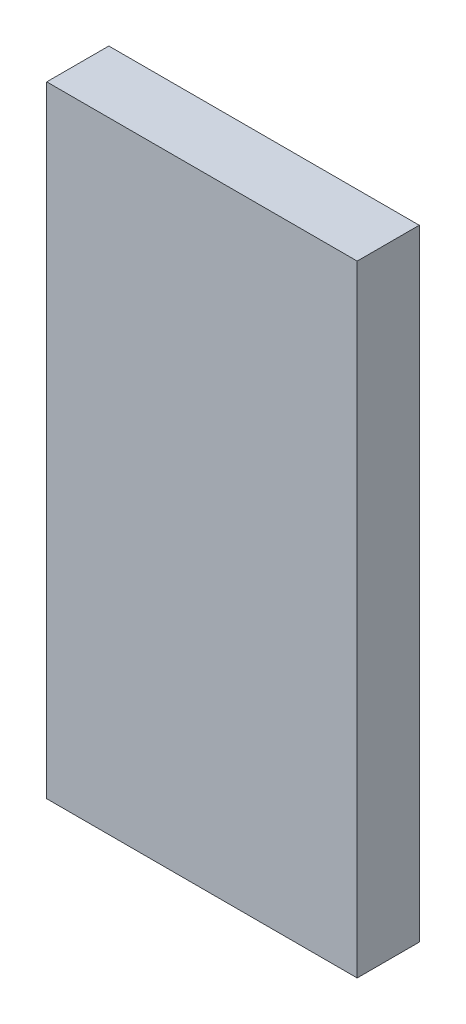
ISO-10303-21;
HEADER;
FILE_DESCRIPTION(('STEP AP214'),'2;1');
FILE_NAME('part.step','',(''),(''),'','','');
FILE_SCHEMA(('AUTOMOTIVE_DESIGN { 1 0 10303 214 1 1 1 1 }'));
ENDSEC;
DATA;
#1=APPLICATION_CONTEXT('core data for automotive mechanical design processes');
#2=APPLICATION_PROTOCOL_DEFINITION('international standard','automotive_design',2000,#1);
#3=PRODUCT_CONTEXT('',#1,'mechanical');
#4=PRODUCT('Part','Part','',(#3));
#5=PRODUCT_RELATED_PRODUCT_CATEGORY('part','',(#4));
#6=PRODUCT_DEFINITION_FORMATION('','',#4);
#7=PRODUCT_DEFINITION_CONTEXT('part definition',#1,'design');
#8=PRODUCT_DEFINITION('design','',#6,#7);
#9=PRODUCT_DEFINITION_SHAPE('','',#8);
#10=(LENGTH_UNIT() NAMED_UNIT(*) SI_UNIT(.MILLI.,.METRE.));
#11=(NAMED_UNIT(*) PLANE_ANGLE_UNIT() SI_UNIT($,.RADIAN.));
#12=(NAMED_UNIT(*) SI_UNIT($,.STERADIAN.) SOLID_ANGLE_UNIT());
#13=UNCERTAINTY_MEASURE_WITH_UNIT(LENGTH_MEASURE(1.E-05),#10,'distance_accuracy_value','');
#14=(GEOMETRIC_REPRESENTATION_CONTEXT(3) GLOBAL_UNCERTAINTY_ASSIGNED_CONTEXT((#13)) GLOBAL_UNIT_ASSIGNED_CONTEXT((#10,
#11,#12)) REPRESENTATION_CONTEXT('',''));
#15=CARTESIAN_POINT('',(0.,0.,0.));
#16=DIRECTION('',(0.,0.,1.));
#17=DIRECTION('',(1.,0.,0.));
#18=AXIS2_PLACEMENT_3D('',#15,#16,#17);
#19=CARTESIAN_POINT('',(30.,-60.,-12.));
#20=DIRECTION('',(1.,0.,0.));
#21=DIRECTION('',(0.,0.,-1.));
#22=AXIS2_PLACEMENT_3D('',#19,#20,#21);
#23=PLANE('',#22);
#24=DIRECTION('',(0.,1.,0.));
#25=VECTOR('',#24,1.);
#26=CARTESIAN_POINT('',(30.,-60.,0.));
#27=LINE('',#26,#25);
#28=CARTESIAN_POINT('',(30.,-60.,0.));
#29=VERTEX_POINT('',#28);
#30=CARTESIAN_POINT('',(30.,60.,0.));
#31=VERTEX_POINT('',#30);
#32=EDGE_CURVE('E98',#29,#31,#27,.T.);
#33=ORIENTED_EDGE('',*,*,#32,.F.);
#34=DIRECTION('',(0.,0.,1.));
#35=VECTOR('',#34,1.);
#36=CARTESIAN_POINT('',(30.,-60.,-12.));
#37=LINE('',#36,#35);
#38=CARTESIAN_POINT('',(30.,-60.,-12.));
#39=VERTEX_POINT('',#38);
#40=EDGE_CURVE('E11',#39,#29,#37,.T.);
#41=ORIENTED_EDGE('',*,*,#40,.F.);
#42=DIRECTION('',(0.,1.,0.));
#43=VECTOR('',#42,1.);
#44=CARTESIAN_POINT('',(30.,-60.,-12.));
#45=LINE('',#44,#43);
#46=CARTESIAN_POINT('',(30.,60.,-12.));
#47=VERTEX_POINT('',#46);
#48=EDGE_CURVE('E92',#39,#47,#45,.T.);
#49=ORIENTED_EDGE('',*,*,#48,.T.);
#50=DIRECTION('',(0.,0.,1.));
#51=VECTOR('',#50,1.);
#52=CARTESIAN_POINT('',(30.,60.,-12.));
#53=LINE('',#52,#51);
#54=EDGE_CURVE('E37',#47,#31,#53,.T.);
#55=ORIENTED_EDGE('',*,*,#54,.T.);
#56=EDGE_LOOP('',(#33,#41,#49,#55));
#57=FACE_BOUND('',#56,.T.);
#58=ADVANCED_FACE('F34',(#57),#23,.T.);
#59=CARTESIAN_POINT('',(-30.,-60.,-12.));
#60=DIRECTION('',(0.,-1.,0.));
#61=DIRECTION('',(0.,0.,-1.));
#62=AXIS2_PLACEMENT_3D('',#59,#60,#61);
#63=PLANE('',#62);
#64=DIRECTION('',(1.,0.,0.));
#65=VECTOR('',#64,1.);
#66=CARTESIAN_POINT('',(-30.,-60.,0.));
#67=LINE('',#66,#65);
#68=CARTESIAN_POINT('',(-30.,-60.,0.));
#69=VERTEX_POINT('',#68);
#70=EDGE_CURVE('E94',#69,#29,#67,.T.);
#71=ORIENTED_EDGE('',*,*,#70,.F.);
#72=DIRECTION('',(0.,0.,1.));
#73=VECTOR('',#72,1.);
#74=CARTESIAN_POINT('',(-30.,-60.,-12.));
#75=LINE('',#74,#73);
#76=CARTESIAN_POINT('',(-30.,-60.,-12.));
#77=VERTEX_POINT('',#76);
#78=EDGE_CURVE('E43',#77,#69,#75,.T.);
#79=ORIENTED_EDGE('',*,*,#78,.F.);
#80=DIRECTION('',(1.,0.,0.));
#81=VECTOR('',#80,1.);
#82=CARTESIAN_POINT('',(-30.,-60.,-12.));
#83=LINE('',#82,#81);
#84=EDGE_CURVE('E89',#77,#39,#83,.T.);
#85=ORIENTED_EDGE('',*,*,#84,.T.);
#86=ORIENTED_EDGE('',*,*,#40,.T.);
#87=EDGE_LOOP('',(#71,#79,#85,#86));
#88=FACE_BOUND('',#87,.T.);
#89=ADVANCED_FACE('F108',(#88),#63,.T.);
#90=CARTESIAN_POINT('',(-30.,-60.,-12.));
#91=DIRECTION('',(-1.,0.,0.));
#92=DIRECTION('',(0.,0.,1.));
#93=AXIS2_PLACEMENT_3D('',#90,#91,#92);
#94=PLANE('',#93);
#95=DIRECTION('',(0.,-1.,0.));
#96=VECTOR('',#95,1.);
#97=CARTESIAN_POINT('',(-30.,-60.,0.));
#98=LINE('',#97,#96);
#99=CARTESIAN_POINT('',(-30.,60.,0.));
#100=VERTEX_POINT('',#99);
#101=EDGE_CURVE('E84',#100,#69,#98,.T.);
#102=ORIENTED_EDGE('',*,*,#101,.F.);
#103=DIRECTION('',(0.,0.,1.));
#104=VECTOR('',#103,1.);
#105=CARTESIAN_POINT('',(-30.,60.,-12.));
#106=LINE('',#105,#104);
#107=CARTESIAN_POINT('',(-30.,60.,-12.));
#108=VERTEX_POINT('',#107);
#109=EDGE_CURVE('E79',#108,#100,#106,.T.);
#110=ORIENTED_EDGE('',*,*,#109,.F.);
#111=DIRECTION('',(0.,-1.,0.));
#112=VECTOR('',#111,1.);
#113=CARTESIAN_POINT('',(-30.,-60.,-12.));
#114=LINE('',#113,#112);
#115=EDGE_CURVE('E82',#108,#77,#114,.T.);
#116=ORIENTED_EDGE('',*,*,#115,.T.);
#117=ORIENTED_EDGE('',*,*,#78,.T.);
#118=EDGE_LOOP('',(#102,#110,#116,#117));
#119=FACE_BOUND('',#118,.T.);
#120=ADVANCED_FACE('F81',(#119),#94,.T.);
#121=CARTESIAN_POINT('',(-30.,60.,-12.));
#122=DIRECTION('',(0.,1.,0.));
#123=DIRECTION('',(0.,0.,1.));
#124=AXIS2_PLACEMENT_3D('',#121,#122,#123);
#125=PLANE('',#124);
#126=DIRECTION('',(-1.,0.,0.));
#127=VECTOR('',#126,1.);
#128=CARTESIAN_POINT('',(-30.,60.,0.));
#129=LINE('',#128,#127);
#130=EDGE_CURVE('E101',#31,#100,#129,.T.);
#131=ORIENTED_EDGE('',*,*,#130,.F.);
#132=ORIENTED_EDGE('',*,*,#54,.F.);
#133=DIRECTION('',(-1.,0.,0.));
#134=VECTOR('',#133,1.);
#135=CARTESIAN_POINT('',(-30.,60.,-12.));
#136=LINE('',#135,#134);
#137=EDGE_CURVE('E88',#47,#108,#136,.T.);
#138=ORIENTED_EDGE('',*,*,#137,.T.);
#139=ORIENTED_EDGE('',*,*,#109,.T.);
#140=EDGE_LOOP('',(#131,#132,#138,#139));
#141=FACE_BOUND('',#140,.T.);
#142=ADVANCED_FACE('F91',(#141),#125,.T.);
#143=CARTESIAN_POINT('',(0.,0.,-12.));
#144=DIRECTION('',(0.,0.,-1.));
#145=DIRECTION('',(-1.,0.,0.));
#146=AXIS2_PLACEMENT_3D('',#143,#144,#145);
#147=PLANE('',#146);
#148=ORIENTED_EDGE('',*,*,#48,.F.);
#149=ORIENTED_EDGE('',*,*,#84,.F.);
#150=ORIENTED_EDGE('',*,*,#115,.F.);
#151=ORIENTED_EDGE('',*,*,#137,.F.);
#152=EDGE_LOOP('',(#148,#149,#150,#151));
#153=FACE_BOUND('',#152,.T.);
#154=ADVANCED_FACE('F87',(#153),#147,.T.);
#155=CARTESIAN_POINT('',(0.,0.,0.));
#156=DIRECTION('',(0.,0.,-1.));
#157=DIRECTION('',(-1.,0.,0.));
#158=AXIS2_PLACEMENT_3D('',#155,#156,#157);
#159=PLANE('',#158);
#160=ORIENTED_EDGE('',*,*,#32,.T.);
#161=ORIENTED_EDGE('',*,*,#130,.T.);
#162=ORIENTED_EDGE('',*,*,#101,.T.);
#163=ORIENTED_EDGE('',*,*,#70,.T.);
#164=EDGE_LOOP('',(#160,#161,#162,#163));
#165=FACE_BOUND('',#164,.T.);
#166=ADVANCED_FACE('F107',(#165),#159,.F.);
#167=CLOSED_SHELL('',(#58,#89,#120,#142,#154,#166));
#168=MANIFOLD_SOLID_BREP('B2',#167);
#169=ADVANCED_BREP_SHAPE_REPRESENTATION('',(#18,#168),#14);
#170=SHAPE_DEFINITION_REPRESENTATION(#9,#169);
ENDSEC;
END-ISO-10303-21;
